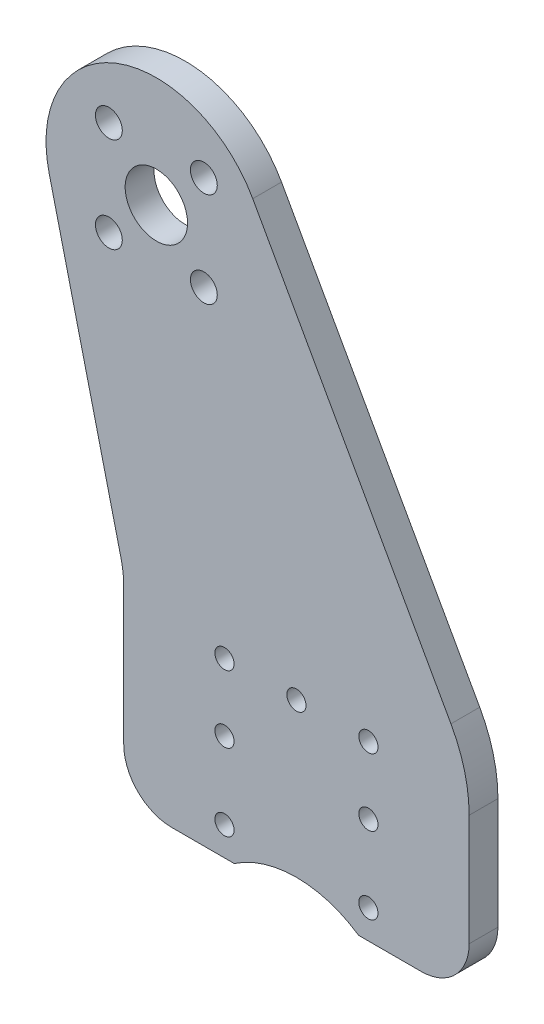
ISO-10303-21;
HEADER;
FILE_DESCRIPTION(('STEP AP214'),'2;1');
FILE_NAME('part.step','',(''),(''),'','','');
FILE_SCHEMA(('AUTOMOTIVE_DESIGN { 1 0 10303 214 1 1 1 1 }'));
ENDSEC;
DATA;
#1=APPLICATION_CONTEXT('core data for automotive mechanical design processes');
#2=APPLICATION_PROTOCOL_DEFINITION('international standard','automotive_design',2000,#1);
#3=PRODUCT_CONTEXT('',#1,'mechanical');
#4=PRODUCT('Part','Part','',(#3));
#5=PRODUCT_RELATED_PRODUCT_CATEGORY('part','',(#4));
#6=PRODUCT_DEFINITION_FORMATION('','',#4);
#7=PRODUCT_DEFINITION_CONTEXT('part definition',#1,'design');
#8=PRODUCT_DEFINITION('design','',#6,#7);
#9=PRODUCT_DEFINITION_SHAPE('','',#8);
#10=(LENGTH_UNIT() NAMED_UNIT(*) SI_UNIT(.MILLI.,.METRE.));
#11=(NAMED_UNIT(*) PLANE_ANGLE_UNIT() SI_UNIT($,.RADIAN.));
#12=(NAMED_UNIT(*) SI_UNIT($,.STERADIAN.) SOLID_ANGLE_UNIT());
#13=UNCERTAINTY_MEASURE_WITH_UNIT(LENGTH_MEASURE(1.E-05),#10,'distance_accuracy_value','');
#14=(GEOMETRIC_REPRESENTATION_CONTEXT(3) GLOBAL_UNCERTAINTY_ASSIGNED_CONTEXT((#13)) GLOBAL_UNIT_ASSIGNED_CONTEXT((#10,
#11,#12)) REPRESENTATION_CONTEXT('',''));
#15=CARTESIAN_POINT('',(0.,0.,0.));
#16=DIRECTION('',(0.,0.,1.));
#17=DIRECTION('',(1.,0.,0.));
#18=AXIS2_PLACEMENT_3D('',#15,#16,#17);
#19=CARTESIAN_POINT('',(14.6,-64.8774999518323,-3.));
#20=DIRECTION('',(0.,0.,1.));
#21=DIRECTION('',(1.,0.,0.));
#22=AXIS2_PLACEMENT_3D('',#19,#20,#21);
#23=CYLINDRICAL_SURFACE('',#22,11.5);
#24=CARTESIAN_POINT('',(14.6,-64.8774999518323,0.));
#25=DIRECTION('',(0.,0.,-1.));
#26=DIRECTION('',(1.,0.,0.));
#27=AXIS2_PLACEMENT_3D('',#24,#25,#26);
#28=CIRCLE('',#27,11.5);
#29=CARTESIAN_POINT('',(8.11925930159214,-55.3774999518323,0.));
#30=VERTEX_POINT('',#29);
#31=CARTESIAN_POINT('',(21.0807406984079,-55.3774999518323,0.));
#32=VERTEX_POINT('',#31);
#33=EDGE_CURVE('E155',#30,#32,#28,.T.);
#34=ORIENTED_EDGE('',*,*,#33,.F.);
#35=DIRECTION('',(0.,0.,1.));
#36=VECTOR('',#35,1.);
#37=CARTESIAN_POINT('',(8.11925930159214,-55.3774999518323,-3.));
#38=LINE('',#37,#36);
#39=CARTESIAN_POINT('',(8.11925930159214,-55.3774999518323,-3.));
#40=VERTEX_POINT('',#39);
#41=EDGE_CURVE('E11',#40,#30,#38,.T.);
#42=ORIENTED_EDGE('',*,*,#41,.F.);
#43=CARTESIAN_POINT('',(14.6,-64.8774999518323,-3.));
#44=DIRECTION('',(0.,0.,-1.));
#45=DIRECTION('',(1.,0.,0.));
#46=AXIS2_PLACEMENT_3D('',#43,#44,#45);
#47=CIRCLE('',#46,11.5);
#48=CARTESIAN_POINT('',(21.0807406984079,-55.3774999518323,-3.));
#49=VERTEX_POINT('',#48);
#50=EDGE_CURVE('E188',#40,#49,#47,.T.);
#51=ORIENTED_EDGE('',*,*,#50,.T.);
#52=DIRECTION('',(0.,0.,1.));
#53=VECTOR('',#52,1.);
#54=CARTESIAN_POINT('',(21.0807406984079,-55.3774999518323,-3.));
#55=LINE('',#54,#53);
#56=EDGE_CURVE('E37',#49,#32,#55,.T.);
#57=ORIENTED_EDGE('',*,*,#56,.T.);
#58=EDGE_LOOP('',(#34,#42,#51,#57));
#59=FACE_BOUND('',#58,.T.);
#60=ADVANCED_FACE('F34',(#59),#23,.F.);
#61=CARTESIAN_POINT('',(1.60000000000004,-55.3774999518323,-3.));
#62=DIRECTION('',(0.,-1.,0.));
#63=DIRECTION('',(0.,0.,-1.));
#64=AXIS2_PLACEMENT_3D('',#61,#62,#63);
#65=PLANE('',#64);
#66=DIRECTION('',(1.,0.,0.));
#67=VECTOR('',#66,1.);
#68=CARTESIAN_POINT('',(1.60000000000004,-55.3774999518323,0.));
#69=LINE('',#68,#67);
#70=CARTESIAN_POINT('',(1.60000000000004,-55.3774999518323,0.));
#71=VERTEX_POINT('',#70);
#72=EDGE_CURVE('E186',#71,#30,#69,.T.);
#73=ORIENTED_EDGE('',*,*,#72,.F.);
#74=DIRECTION('',(0.,0.,1.));
#75=VECTOR('',#74,1.);
#76=CARTESIAN_POINT('',(1.60000000000004,-55.3774999518323,-3.));
#77=LINE('',#76,#75);
#78=CARTESIAN_POINT('',(1.60000000000004,-55.3774999518323,-3.));
#79=VERTEX_POINT('',#78);
#80=EDGE_CURVE('E43',#79,#71,#77,.T.);
#81=ORIENTED_EDGE('',*,*,#80,.F.);
#82=DIRECTION('',(1.,0.,0.));
#83=VECTOR('',#82,1.);
#84=CARTESIAN_POINT('',(1.60000000000004,-55.3774999518323,-3.));
#85=LINE('',#84,#83);
#86=EDGE_CURVE('E145',#79,#40,#85,.T.);
#87=ORIENTED_EDGE('',*,*,#86,.T.);
#88=ORIENTED_EDGE('',*,*,#41,.T.);
#89=EDGE_LOOP('',(#73,#81,#87,#88));
#90=FACE_BOUND('',#89,.T.);
#91=ADVANCED_FACE('F208',(#90),#65,.T.);
#92=CARTESIAN_POINT('',(1.60000000000001,-50.3774999518323,-3.));
#93=DIRECTION('',(0.,0.,1.));
#94=DIRECTION('',(1.,0.,0.));
#95=AXIS2_PLACEMENT_3D('',#92,#93,#94);
#96=CYLINDRICAL_SURFACE('',#95,5.);
#97=CARTESIAN_POINT('',(1.60000000000001,-50.3774999518323,0.));
#98=DIRECTION('',(0.,0.,1.));
#99=DIRECTION('',(-1.,0.,0.));
#100=AXIS2_PLACEMENT_3D('',#97,#98,#99);
#101=CIRCLE('',#100,5.);
#102=CARTESIAN_POINT('',(-3.39999999999999,-50.3774999518323,0.));
#103=VERTEX_POINT('',#102);
#104=EDGE_CURVE('E132',#103,#71,#101,.T.);
#105=ORIENTED_EDGE('',*,*,#104,.F.);
#106=DIRECTION('',(0.,0.,1.));
#107=VECTOR('',#106,1.);
#108=CARTESIAN_POINT('',(-3.39999999999999,-50.3774999518323,-3.));
#109=LINE('',#108,#107);
#110=CARTESIAN_POINT('',(-3.39999999999999,-50.3774999518323,-3.));
#111=VERTEX_POINT('',#110);
#112=EDGE_CURVE('E127',#111,#103,#109,.T.);
#113=ORIENTED_EDGE('',*,*,#112,.F.);
#114=CARTESIAN_POINT('',(1.60000000000001,-50.3774999518323,-3.));
#115=DIRECTION('',(0.,0.,1.));
#116=DIRECTION('',(-1.,0.,0.));
#117=AXIS2_PLACEMENT_3D('',#114,#115,#116);
#118=CIRCLE('',#117,5.);
#119=EDGE_CURVE('E130',#111,#79,#118,.T.);
#120=ORIENTED_EDGE('',*,*,#119,.T.);
#121=ORIENTED_EDGE('',*,*,#80,.T.);
#122=EDGE_LOOP('',(#105,#113,#120,#121));
#123=FACE_BOUND('',#122,.T.);
#124=ADVANCED_FACE('F129',(#123),#96,.T.);
#125=CARTESIAN_POINT('',(-3.39999999999999,-36.0690336243878,-3.));
#126=DIRECTION('',(-1.,0.,0.));
#127=DIRECTION('',(0.,0.,1.));
#128=AXIS2_PLACEMENT_3D('',#125,#126,#127);
#129=PLANE('',#128);
#130=DIRECTION('',(0.,-1.,0.));
#131=VECTOR('',#130,1.);
#132=CARTESIAN_POINT('',(-3.39999999999999,-36.0690336243878,0.));
#133=LINE('',#132,#131);
#134=CARTESIAN_POINT('',(-3.39999999999999,-36.0690336243878,0.));
#135=VERTEX_POINT('',#134);
#136=EDGE_CURVE('E183',#135,#103,#133,.T.);
#137=ORIENTED_EDGE('',*,*,#136,.F.);
#138=DIRECTION('',(0.,0.,1.));
#139=VECTOR('',#138,1.);
#140=CARTESIAN_POINT('',(-3.39999999999999,-36.0690336243878,-3.));
#141=LINE('',#140,#139);
#142=CARTESIAN_POINT('',(-3.39999999999999,-36.0690336243878,-3.));
#143=VERTEX_POINT('',#142);
#144=EDGE_CURVE('E137',#143,#135,#141,.T.);
#145=ORIENTED_EDGE('',*,*,#144,.F.);
#146=DIRECTION('',(0.,-1.,0.));
#147=VECTOR('',#146,1.);
#148=CARTESIAN_POINT('',(-3.39999999999999,-36.0690336243878,-3.));
#149=LINE('',#148,#147);
#150=EDGE_CURVE('E143',#143,#111,#149,.T.);
#151=ORIENTED_EDGE('',*,*,#150,.T.);
#152=ORIENTED_EDGE('',*,*,#112,.T.);
#153=EDGE_LOOP('',(#137,#145,#151,#152));
#154=FACE_BOUND('',#153,.T.);
#155=ADVANCED_FACE('F147',(#154),#129,.T.);
#156=CARTESIAN_POINT('',(-13.4,-36.0690336243878,-3.));
#157=DIRECTION('',(0.,0.,1.));
#158=DIRECTION('',(1.,0.,0.));
#159=AXIS2_PLACEMENT_3D('',#156,#157,#158);
#160=CYLINDRICAL_SURFACE('',#159,10.);
#161=CARTESIAN_POINT('',(-13.4,-36.0690336243878,0.));
#162=DIRECTION('',(0.,0.,-1.));
#163=DIRECTION('',(1.,0.,0.));
#164=AXIS2_PLACEMENT_3D('',#161,#162,#163);
#165=CIRCLE('',#164,10.);
#166=CARTESIAN_POINT('',(-3.67997553887423,-33.7193263074828,0.));
#167=VERTEX_POINT('',#166);
#168=EDGE_CURVE('E180',#167,#135,#165,.T.);
#169=ORIENTED_EDGE('',*,*,#168,.F.);
#170=DIRECTION('',(0.,0.,1.));
#171=VECTOR('',#170,1.);
#172=CARTESIAN_POINT('',(-3.67997553887423,-33.7193263074828,-3.));
#173=LINE('',#172,#171);
#174=CARTESIAN_POINT('',(-3.67997553887423,-33.7193263074828,-3.));
#175=VERTEX_POINT('',#174);
#176=EDGE_CURVE('E192',#175,#167,#173,.T.);
#177=ORIENTED_EDGE('',*,*,#176,.F.);
#178=CARTESIAN_POINT('',(-13.4,-36.0690336243878,-3.));
#179=DIRECTION('',(0.,0.,-1.));
#180=DIRECTION('',(1.,0.,0.));
#181=AXIS2_PLACEMENT_3D('',#178,#179,#180);
#182=CIRCLE('',#181,10.);
#183=EDGE_CURVE('E148',#175,#143,#182,.T.);
#184=ORIENTED_EDGE('',*,*,#183,.T.);
#185=ORIENTED_EDGE('',*,*,#144,.T.);
#186=EDGE_LOOP('',(#169,#177,#184,#185));
#187=FACE_BOUND('',#186,.T.);
#188=ADVANCED_FACE('F221',(#187),#160,.F.);
#189=CARTESIAN_POINT('',(-3.67997553887423,-33.7193263074828,-3.));
#190=DIRECTION('',(-0.972002446112577,-0.234970731690495,0.));
#191=DIRECTION('',(0.234970731690495,-0.972002446112577,0.));
#192=AXIS2_PLACEMENT_3D('',#189,#190,#191);
#193=PLANE('',#192);
#194=DIRECTION('',(0.234970731690495,-0.972002446112577,0.));
#195=VECTOR('',#194,1.);
#196=CARTESIAN_POINT('',(-3.67997553887423,-33.7193263074828,0.));
#197=LINE('',#196,#195);
#198=CARTESIAN_POINT('',(-11.1780281302946,-2.70216341444069,0.));
#199=VERTEX_POINT('',#198);
#200=EDGE_CURVE('E177',#199,#167,#197,.T.);
#201=ORIENTED_EDGE('',*,*,#200,.F.);
#202=DIRECTION('',(0.,0.,1.));
#203=VECTOR('',#202,1.);
#204=CARTESIAN_POINT('',(-11.1780281302946,-2.70216341444069,-3.));
#205=LINE('',#204,#203);
#206=CARTESIAN_POINT('',(-11.1780281302946,-2.70216341444069,-3.));
#207=VERTEX_POINT('',#206);
#208=EDGE_CURVE('E194',#207,#199,#205,.T.);
#209=ORIENTED_EDGE('',*,*,#208,.F.);
#210=DIRECTION('',(0.234970731690495,-0.972002446112577,0.));
#211=VECTOR('',#210,1.);
#212=CARTESIAN_POINT('',(-3.67997553887423,-33.7193263074828,-3.));
#213=LINE('',#212,#211);
#214=EDGE_CURVE('E150',#207,#175,#213,.T.);
#215=ORIENTED_EDGE('',*,*,#214,.T.);
#216=ORIENTED_EDGE('',*,*,#176,.T.);
#217=EDGE_LOOP('',(#201,#209,#215,#216));
#218=FACE_BOUND('',#217,.T.);
#219=ADVANCED_FACE('F224',(#218),#193,.T.);
#220=CARTESIAN_POINT('',(0.,0.,-3.));
#221=DIRECTION('',(0.,0.,1.));
#222=DIRECTION('',(1.,0.,0.));
#223=AXIS2_PLACEMENT_3D('',#220,#221,#222);
#224=CYLINDRICAL_SURFACE('',#223,11.5);
#225=CARTESIAN_POINT('',(0.,0.,0.));
#226=DIRECTION('',(0.,0.,1.));
#227=DIRECTION('',(1.,0.,0.));
#228=AXIS2_PLACEMENT_3D('',#225,#226,#227);
#229=CIRCLE('',#228,11.5);
#230=CARTESIAN_POINT('',(10.0456256403877,5.59780363117403,0.));
#231=VERTEX_POINT('',#230);
#232=EDGE_CURVE('E174',#231,#199,#229,.T.);
#233=ORIENTED_EDGE('',*,*,#232,.F.);
#234=DIRECTION('',(0.,0.,1.));
#235=VECTOR('',#234,1.);
#236=CARTESIAN_POINT('',(10.0456256403877,5.59780363117403,-3.));
#237=LINE('',#236,#235);
#238=CARTESIAN_POINT('',(10.0456256403877,5.59780363117403,-3.));
#239=VERTEX_POINT('',#238);
#240=EDGE_CURVE('E196',#239,#231,#237,.T.);
#241=ORIENTED_EDGE('',*,*,#240,.F.);
#242=CARTESIAN_POINT('',(0.,0.,-3.));
#243=DIRECTION('',(0.,0.,1.));
#244=DIRECTION('',(1.,0.,0.));
#245=AXIS2_PLACEMENT_3D('',#242,#243,#244);
#246=CIRCLE('',#245,11.5);
#247=EDGE_CURVE('E398',#239,#207,#246,.T.);
#248=ORIENTED_EDGE('',*,*,#247,.T.);
#249=ORIENTED_EDGE('',*,*,#208,.T.);
#250=EDGE_LOOP('',(#233,#241,#248,#249));
#251=FACE_BOUND('',#250,.T.);
#252=ADVANCED_FACE('F228',(#251),#224,.T.);
#253=CARTESIAN_POINT('',(30.7029899657231,-31.4731910664189,-3.));
#254=DIRECTION('',(0.873532664381539,0.486765533145568,0.));
#255=DIRECTION('',(-0.486765533145568,0.873532664381539,0.));
#256=AXIS2_PLACEMENT_3D('',#253,#254,#255);
#257=PLANE('',#256);
#258=DIRECTION('',(-0.486765533145568,0.873532664381539,0.));
#259=VECTOR('',#258,1.);
#260=CARTESIAN_POINT('',(30.7029899657231,-31.4731910664189,0.));
#261=LINE('',#260,#259);
#262=CARTESIAN_POINT('',(30.7029899657231,-31.4731910664189,0.));
#263=VERTEX_POINT('',#262);
#264=EDGE_CURVE('E171',#263,#231,#261,.T.);
#265=ORIENTED_EDGE('',*,*,#264,.F.);
#266=DIRECTION('',(0.,0.,1.));
#267=VECTOR('',#266,1.);
#268=CARTESIAN_POINT('',(30.7029899657231,-31.4731910664189,-3.));
#269=LINE('',#268,#267);
#270=CARTESIAN_POINT('',(30.7029899657231,-31.4731910664189,-3.));
#271=VERTEX_POINT('',#270);
#272=EDGE_CURVE('E198',#271,#263,#269,.T.);
#273=ORIENTED_EDGE('',*,*,#272,.F.);
#274=DIRECTION('',(-0.486765533145568,0.873532664381539,0.));
#275=VECTOR('',#274,1.);
#276=CARTESIAN_POINT('',(30.7029899657231,-31.4731910664189,-3.));
#277=LINE('',#276,#275);
#278=EDGE_CURVE('E395',#271,#239,#277,.T.);
#279=ORIENTED_EDGE('',*,*,#278,.T.);
#280=ORIENTED_EDGE('',*,*,#240,.T.);
#281=EDGE_LOOP('',(#265,#273,#279,#280));
#282=FACE_BOUND('',#281,.T.);
#283=ADVANCED_FACE('F232',(#282),#257,.T.);
#284=CARTESIAN_POINT('',(17.6,-38.7746740636025,-3.));
#285=DIRECTION('',(0.,0.,1.));
#286=DIRECTION('',(1.,0.,0.));
#287=AXIS2_PLACEMENT_3D('',#284,#285,#286);
#288=CYLINDRICAL_SURFACE('',#287,15.);
#289=CARTESIAN_POINT('',(17.6,-38.7746740636025,0.));
#290=DIRECTION('',(0.,0.,1.));
#291=DIRECTION('',(1.,0.,0.));
#292=AXIS2_PLACEMENT_3D('',#289,#290,#291);
#293=CIRCLE('',#292,15.);
#294=CARTESIAN_POINT('',(32.6,-38.7746740636025,0.));
#295=VERTEX_POINT('',#294);
#296=EDGE_CURVE('E168',#295,#263,#293,.T.);
#297=ORIENTED_EDGE('',*,*,#296,.F.);
#298=DIRECTION('',(0.,0.,1.));
#299=VECTOR('',#298,1.);
#300=CARTESIAN_POINT('',(32.6,-38.7746740636025,-3.));
#301=LINE('',#300,#299);
#302=CARTESIAN_POINT('',(32.6,-38.7746740636025,-3.));
#303=VERTEX_POINT('',#302);
#304=EDGE_CURVE('E200',#303,#295,#301,.T.);
#305=ORIENTED_EDGE('',*,*,#304,.F.);
#306=CARTESIAN_POINT('',(17.6,-38.7746740636025,-3.));
#307=DIRECTION('',(0.,0.,1.));
#308=DIRECTION('',(1.,0.,0.));
#309=AXIS2_PLACEMENT_3D('',#306,#307,#308);
#310=CIRCLE('',#309,15.);
#311=EDGE_CURVE('E392',#303,#271,#310,.T.);
#312=ORIENTED_EDGE('',*,*,#311,.T.);
#313=ORIENTED_EDGE('',*,*,#272,.T.);
#314=EDGE_LOOP('',(#297,#305,#312,#313));
#315=FACE_BOUND('',#314,.T.);
#316=ADVANCED_FACE('F236',(#315),#288,.T.);
#317=CARTESIAN_POINT('',(32.6,-38.7746740636025,-3.));
#318=DIRECTION('',(1.,0.,0.));
#319=DIRECTION('',(0.,0.,-1.));
#320=AXIS2_PLACEMENT_3D('',#317,#318,#319);
#321=PLANE('',#320);
#322=DIRECTION('',(0.,1.,0.));
#323=VECTOR('',#322,1.);
#324=CARTESIAN_POINT('',(32.6,-38.7746740636025,0.));
#325=LINE('',#324,#323);
#326=CARTESIAN_POINT('',(32.6,-50.3774999518323,0.));
#327=VERTEX_POINT('',#326);
#328=EDGE_CURVE('E165',#327,#295,#325,.T.);
#329=ORIENTED_EDGE('',*,*,#328,.F.);
#330=DIRECTION('',(0.,0.,1.));
#331=VECTOR('',#330,1.);
#332=CARTESIAN_POINT('',(32.6,-50.3774999518323,-3.));
#333=LINE('',#332,#331);
#334=CARTESIAN_POINT('',(32.6,-50.3774999518323,-3.));
#335=VERTEX_POINT('',#334);
#336=EDGE_CURVE('E202',#335,#327,#333,.T.);
#337=ORIENTED_EDGE('',*,*,#336,.F.);
#338=DIRECTION('',(0.,1.,0.));
#339=VECTOR('',#338,1.);
#340=CARTESIAN_POINT('',(32.6,-38.7746740636025,-3.));
#341=LINE('',#340,#339);
#342=EDGE_CURVE('E389',#335,#303,#341,.T.);
#343=ORIENTED_EDGE('',*,*,#342,.T.);
#344=ORIENTED_EDGE('',*,*,#304,.T.);
#345=EDGE_LOOP('',(#329,#337,#343,#344));
#346=FACE_BOUND('',#345,.T.);
#347=ADVANCED_FACE('F240',(#346),#321,.T.);
#348=CARTESIAN_POINT('',(27.6,-50.3774999518323,-3.));
#349=DIRECTION('',(0.,0.,1.));
#350=DIRECTION('',(1.,0.,0.));
#351=AXIS2_PLACEMENT_3D('',#348,#349,#350);
#352=CYLINDRICAL_SURFACE('',#351,5.);
#353=CARTESIAN_POINT('',(27.6,-50.3774999518323,0.));
#354=DIRECTION('',(0.,0.,1.));
#355=DIRECTION('',(-1.,0.,0.));
#356=AXIS2_PLACEMENT_3D('',#353,#354,#355);
#357=CIRCLE('',#356,5.);
#358=CARTESIAN_POINT('',(27.6,-55.3774999518323,0.));
#359=VERTEX_POINT('',#358);
#360=EDGE_CURVE('E162',#359,#327,#357,.T.);
#361=ORIENTED_EDGE('',*,*,#360,.F.);
#362=DIRECTION('',(0.,0.,1.));
#363=VECTOR('',#362,1.);
#364=CARTESIAN_POINT('',(27.6,-55.3774999518323,-3.));
#365=LINE('',#364,#363);
#366=CARTESIAN_POINT('',(27.6,-55.3774999518323,-3.));
#367=VERTEX_POINT('',#366);
#368=EDGE_CURVE('E203',#367,#359,#365,.T.);
#369=ORIENTED_EDGE('',*,*,#368,.F.);
#370=CARTESIAN_POINT('',(27.6,-50.3774999518323,-3.));
#371=DIRECTION('',(0.,0.,1.));
#372=DIRECTION('',(-1.,0.,0.));
#373=AXIS2_PLACEMENT_3D('',#370,#371,#372);
#374=CIRCLE('',#373,5.);
#375=EDGE_CURVE('E386',#367,#335,#374,.T.);
#376=ORIENTED_EDGE('',*,*,#375,.T.);
#377=ORIENTED_EDGE('',*,*,#336,.T.);
#378=EDGE_LOOP('',(#361,#369,#376,#377));
#379=FACE_BOUND('',#378,.T.);
#380=ADVANCED_FACE('F244',(#379),#352,.T.);
#381=CARTESIAN_POINT('',(21.0807406984079,-55.3774999518323,-3.));
#382=DIRECTION('',(0.,-1.,0.));
#383=DIRECTION('',(0.,0.,-1.));
#384=AXIS2_PLACEMENT_3D('',#381,#382,#383);
#385=PLANE('',#384);
#386=DIRECTION('',(1.,0.,0.));
#387=VECTOR('',#386,1.);
#388=CARTESIAN_POINT('',(21.0807406984079,-55.3774999518323,0.));
#389=LINE('',#388,#387);
#390=EDGE_CURVE('E158',#32,#359,#389,.T.);
#391=ORIENTED_EDGE('',*,*,#390,.F.);
#392=ORIENTED_EDGE('',*,*,#56,.F.);
#393=DIRECTION('',(1.,0.,0.));
#394=VECTOR('',#393,1.);
#395=CARTESIAN_POINT('',(21.0807406984079,-55.3774999518323,-3.));
#396=LINE('',#395,#394);
#397=EDGE_CURVE('E384',#49,#367,#396,.T.);
#398=ORIENTED_EDGE('',*,*,#397,.T.);
#399=ORIENTED_EDGE('',*,*,#368,.T.);
#400=EDGE_LOOP('',(#391,#392,#398,#399));
#401=FACE_BOUND('',#400,.T.);
#402=ADVANCED_FACE('F205',(#401),#385,.T.);
#403=CARTESIAN_POINT('',(14.6,-64.8774999518323,-3.));
#404=DIRECTION('',(0.,0.,1.));
#405=DIRECTION('',(1.,0.,0.));
#406=AXIS2_PLACEMENT_3D('',#403,#404,#405);
#407=PLANE('',#406);
#408=CARTESIAN_POINT('',(7.10000000000001,-44.3774999518323,-3.));
#409=DIRECTION('',(0.,0.,1.));
#410=DIRECTION('',(1.,0.,0.));
#411=AXIS2_PLACEMENT_3D('',#408,#409,#410);
#412=CIRCLE('',#411,1.);
#413=CARTESIAN_POINT('',(8.10000000000001,-44.3774999518323,-3.));
#414=VERTEX_POINT('',#413);
#415=EDGE_CURVE('E311',#414,#414,#412,.T.);
#416=ORIENTED_EDGE('',*,*,#415,.T.);
#417=EDGE_LOOP('',(#416));
#418=FACE_BOUND('',#417,.T.);
#419=CARTESIAN_POINT('',(22.1,-44.3774999518323,-3.));
#420=DIRECTION('',(0.,0.,1.));
#421=DIRECTION('',(1.,0.,0.));
#422=AXIS2_PLACEMENT_3D('',#419,#420,#421);
#423=CIRCLE('',#422,1.);
#424=CARTESIAN_POINT('',(23.1,-44.3774999518323,-3.));
#425=VERTEX_POINT('',#424);
#426=EDGE_CURVE('E319',#425,#425,#423,.T.);
#427=ORIENTED_EDGE('',*,*,#426,.T.);
#428=EDGE_LOOP('',(#427));
#429=FACE_BOUND('',#428,.T.);
#430=CARTESIAN_POINT('',(14.6,-37.3774999518323,-3.));
#431=DIRECTION('',(0.,0.,1.));
#432=DIRECTION('',(1.,0.,0.));
#433=AXIS2_PLACEMENT_3D('',#430,#431,#432);
#434=CIRCLE('',#433,1.);
#435=CARTESIAN_POINT('',(15.6,-37.3774999518323,-3.));
#436=VERTEX_POINT('',#435);
#437=EDGE_CURVE('E325',#436,#436,#434,.T.);
#438=ORIENTED_EDGE('',*,*,#437,.T.);
#439=EDGE_LOOP('',(#438));
#440=FACE_BOUND('',#439,.T.);
#441=CARTESIAN_POINT('',(22.1,-52.3774999518323,-3.));
#442=DIRECTION('',(0.,0.,1.));
#443=DIRECTION('',(1.,0.,0.));
#444=AXIS2_PLACEMENT_3D('',#441,#442,#443);
#445=CIRCLE('',#444,1.);
#446=CARTESIAN_POINT('',(23.1,-52.3774999518323,-3.));
#447=VERTEX_POINT('',#446);
#448=EDGE_CURVE('E331',#447,#447,#445,.T.);
#449=ORIENTED_EDGE('',*,*,#448,.T.);
#450=EDGE_LOOP('',(#449));
#451=FACE_BOUND('',#450,.T.);
#452=CARTESIAN_POINT('',(7.10000000000001,-52.3774999518323,-3.));
#453=DIRECTION('',(0.,0.,1.));
#454=DIRECTION('',(1.,0.,0.));
#455=AXIS2_PLACEMENT_3D('',#452,#453,#454);
#456=CIRCLE('',#455,1.);
#457=CARTESIAN_POINT('',(8.10000000000001,-52.3774999518323,-3.));
#458=VERTEX_POINT('',#457);
#459=EDGE_CURVE('E337',#458,#458,#456,.T.);
#460=ORIENTED_EDGE('',*,*,#459,.T.);
#461=EDGE_LOOP('',(#460));
#462=FACE_BOUND('',#461,.T.);
#463=CARTESIAN_POINT('',(22.1,-37.3774999518323,-3.));
#464=DIRECTION('',(0.,0.,1.));
#465=DIRECTION('',(1.,0.,0.));
#466=AXIS2_PLACEMENT_3D('',#463,#464,#465);
#467=CIRCLE('',#466,1.);
#468=CARTESIAN_POINT('',(23.1,-37.3774999518323,-3.));
#469=VERTEX_POINT('',#468);
#470=EDGE_CURVE('E343',#469,#469,#467,.T.);
#471=ORIENTED_EDGE('',*,*,#470,.T.);
#472=EDGE_LOOP('',(#471));
#473=FACE_BOUND('',#472,.T.);
#474=CARTESIAN_POINT('',(7.10000000000001,-37.3774999518323,-3.));
#475=DIRECTION('',(0.,0.,1.));
#476=DIRECTION('',(1.,0.,0.));
#477=AXIS2_PLACEMENT_3D('',#474,#475,#476);
#478=CIRCLE('',#477,1.);
#479=CARTESIAN_POINT('',(8.10000000000001,-37.3774999518323,-3.));
#480=VERTEX_POINT('',#479);
#481=EDGE_CURVE('E349',#480,#480,#478,.T.);
#482=ORIENTED_EDGE('',*,*,#481,.T.);
#483=EDGE_LOOP('',(#482));
#484=FACE_BOUND('',#483,.T.);
#485=CARTESIAN_POINT('',(-4.94974746830583,-4.94974746830583,-3.));
#486=DIRECTION('',(0.,0.,1.));
#487=DIRECTION('',(1.,0.,0.));
#488=AXIS2_PLACEMENT_3D('',#485,#486,#487);
#489=CIRCLE('',#488,1.4);
#490=CARTESIAN_POINT('',(-3.54974746830583,-4.94974746830583,-3.));
#491=VERTEX_POINT('',#490);
#492=EDGE_CURVE('E355',#491,#491,#489,.T.);
#493=ORIENTED_EDGE('',*,*,#492,.T.);
#494=EDGE_LOOP('',(#493));
#495=FACE_BOUND('',#494,.T.);
#496=CARTESIAN_POINT('',(4.94974746830583,-4.94974746830583,-3.));
#497=DIRECTION('',(0.,0.,1.));
#498=DIRECTION('',(1.,0.,0.));
#499=AXIS2_PLACEMENT_3D('',#496,#497,#498);
#500=CIRCLE('',#499,1.4);
#501=CARTESIAN_POINT('',(6.34974746830583,-4.94974746830583,-3.));
#502=VERTEX_POINT('',#501);
#503=EDGE_CURVE('E361',#502,#502,#500,.T.);
#504=ORIENTED_EDGE('',*,*,#503,.T.);
#505=EDGE_LOOP('',(#504));
#506=FACE_BOUND('',#505,.T.);
#507=CARTESIAN_POINT('',(4.94974746830583,4.94974746830583,-3.));
#508=DIRECTION('',(0.,0.,1.));
#509=DIRECTION('',(1.,0.,0.));
#510=AXIS2_PLACEMENT_3D('',#507,#508,#509);
#511=CIRCLE('',#510,1.4);
#512=CARTESIAN_POINT('',(6.34974746830583,4.94974746830583,-3.));
#513=VERTEX_POINT('',#512);
#514=EDGE_CURVE('E367',#513,#513,#511,.T.);
#515=ORIENTED_EDGE('',*,*,#514,.T.);
#516=EDGE_LOOP('',(#515));
#517=FACE_BOUND('',#516,.T.);
#518=CARTESIAN_POINT('',(-4.94974746830583,4.94974746830583,-3.));
#519=DIRECTION('',(0.,0.,1.));
#520=DIRECTION('',(1.,0.,0.));
#521=AXIS2_PLACEMENT_3D('',#518,#519,#520);
#522=CIRCLE('',#521,1.4);
#523=CARTESIAN_POINT('',(-3.54974746830583,4.94974746830583,-3.));
#524=VERTEX_POINT('',#523);
#525=EDGE_CURVE('E373',#524,#524,#522,.T.);
#526=ORIENTED_EDGE('',*,*,#525,.T.);
#527=EDGE_LOOP('',(#526));
#528=FACE_BOUND('',#527,.T.);
#529=CARTESIAN_POINT('',(0.,0.,-3.));
#530=DIRECTION('',(0.,0.,1.));
#531=DIRECTION('',(1.,0.,0.));
#532=AXIS2_PLACEMENT_3D('',#529,#530,#531);
#533=CIRCLE('',#532,3.25);
#534=CARTESIAN_POINT('',(3.25,0.,-3.));
#535=VERTEX_POINT('',#534);
#536=EDGE_CURVE('E159',#535,#535,#533,.T.);
#537=ORIENTED_EDGE('',*,*,#536,.T.);
#538=EDGE_LOOP('',(#537));
#539=FACE_BOUND('',#538,.T.);
#540=ORIENTED_EDGE('',*,*,#50,.F.);
#541=ORIENTED_EDGE('',*,*,#86,.F.);
#542=ORIENTED_EDGE('',*,*,#119,.F.);
#543=ORIENTED_EDGE('',*,*,#150,.F.);
#544=ORIENTED_EDGE('',*,*,#183,.F.);
#545=ORIENTED_EDGE('',*,*,#214,.F.);
#546=ORIENTED_EDGE('',*,*,#247,.F.);
#547=ORIENTED_EDGE('',*,*,#278,.F.);
#548=ORIENTED_EDGE('',*,*,#311,.F.);
#549=ORIENTED_EDGE('',*,*,#342,.F.);
#550=ORIENTED_EDGE('',*,*,#375,.F.);
#551=ORIENTED_EDGE('',*,*,#397,.F.);
#552=EDGE_LOOP('',(#540,#541,#542,#543,#544,#545,#546,#547,#548,#549,#550,#551));
#553=FACE_BOUND('',#552,.T.);
#554=ADVANCED_FACE('F141',(#418,#429,#440,#451,#462,#473,#484,#495,#506,#517,#528,#539,#553),
#407,.F.);
#555=CARTESIAN_POINT('',(14.6,-64.8774999518323,0.));
#556=DIRECTION('',(0.,0.,1.));
#557=DIRECTION('',(1.,0.,0.));
#558=AXIS2_PLACEMENT_3D('',#555,#556,#557);
#559=PLANE('',#558);
#560=CARTESIAN_POINT('',(7.10000000000001,-44.3774999518323,0.));
#561=DIRECTION('',(0.,0.,1.));
#562=DIRECTION('',(1.,0.,0.));
#563=AXIS2_PLACEMENT_3D('',#560,#561,#562);
#564=CIRCLE('',#563,1.);
#565=CARTESIAN_POINT('',(8.10000000000001,-44.3774999518323,0.));
#566=VERTEX_POINT('',#565);
#567=EDGE_CURVE('E314',#566,#566,#564,.T.);
#568=ORIENTED_EDGE('',*,*,#567,.F.);
#569=EDGE_LOOP('',(#568));
#570=FACE_BOUND('',#569,.T.);
#571=CARTESIAN_POINT('',(22.1,-44.3774999518323,0.));
#572=DIRECTION('',(0.,0.,1.));
#573=DIRECTION('',(1.,0.,0.));
#574=AXIS2_PLACEMENT_3D('',#571,#572,#573);
#575=CIRCLE('',#574,1.);
#576=CARTESIAN_POINT('',(23.1,-44.3774999518323,0.));
#577=VERTEX_POINT('',#576);
#578=EDGE_CURVE('E316',#577,#577,#575,.T.);
#579=ORIENTED_EDGE('',*,*,#578,.F.);
#580=EDGE_LOOP('',(#579));
#581=FACE_BOUND('',#580,.T.);
#582=CARTESIAN_POINT('',(14.6,-37.3774999518323,0.));
#583=DIRECTION('',(0.,0.,1.));
#584=DIRECTION('',(1.,0.,0.));
#585=AXIS2_PLACEMENT_3D('',#582,#583,#584);
#586=CIRCLE('',#585,1.);
#587=CARTESIAN_POINT('',(15.6,-37.3774999518323,0.));
#588=VERTEX_POINT('',#587);
#589=EDGE_CURVE('E322',#588,#588,#586,.T.);
#590=ORIENTED_EDGE('',*,*,#589,.F.);
#591=EDGE_LOOP('',(#590));
#592=FACE_BOUND('',#591,.T.);
#593=CARTESIAN_POINT('',(22.1,-52.3774999518323,0.));
#594=DIRECTION('',(0.,0.,1.));
#595=DIRECTION('',(1.,0.,0.));
#596=AXIS2_PLACEMENT_3D('',#593,#594,#595);
#597=CIRCLE('',#596,1.);
#598=CARTESIAN_POINT('',(23.1,-52.3774999518323,0.));
#599=VERTEX_POINT('',#598);
#600=EDGE_CURVE('E328',#599,#599,#597,.T.);
#601=ORIENTED_EDGE('',*,*,#600,.F.);
#602=EDGE_LOOP('',(#601));
#603=FACE_BOUND('',#602,.T.);
#604=CARTESIAN_POINT('',(7.10000000000001,-52.3774999518323,0.));
#605=DIRECTION('',(0.,0.,1.));
#606=DIRECTION('',(1.,0.,0.));
#607=AXIS2_PLACEMENT_3D('',#604,#605,#606);
#608=CIRCLE('',#607,1.);
#609=CARTESIAN_POINT('',(8.10000000000001,-52.3774999518323,0.));
#610=VERTEX_POINT('',#609);
#611=EDGE_CURVE('E334',#610,#610,#608,.T.);
#612=ORIENTED_EDGE('',*,*,#611,.F.);
#613=EDGE_LOOP('',(#612));
#614=FACE_BOUND('',#613,.T.);
#615=CARTESIAN_POINT('',(22.1,-37.3774999518323,0.));
#616=DIRECTION('',(0.,0.,1.));
#617=DIRECTION('',(1.,0.,0.));
#618=AXIS2_PLACEMENT_3D('',#615,#616,#617);
#619=CIRCLE('',#618,1.);
#620=CARTESIAN_POINT('',(23.1,-37.3774999518323,0.));
#621=VERTEX_POINT('',#620);
#622=EDGE_CURVE('E340',#621,#621,#619,.T.);
#623=ORIENTED_EDGE('',*,*,#622,.F.);
#624=EDGE_LOOP('',(#623));
#625=FACE_BOUND('',#624,.T.);
#626=CARTESIAN_POINT('',(7.10000000000001,-37.3774999518323,0.));
#627=DIRECTION('',(0.,0.,1.));
#628=DIRECTION('',(1.,0.,0.));
#629=AXIS2_PLACEMENT_3D('',#626,#627,#628);
#630=CIRCLE('',#629,1.);
#631=CARTESIAN_POINT('',(8.10000000000001,-37.3774999518323,0.));
#632=VERTEX_POINT('',#631);
#633=EDGE_CURVE('E346',#632,#632,#630,.T.);
#634=ORIENTED_EDGE('',*,*,#633,.F.);
#635=EDGE_LOOP('',(#634));
#636=FACE_BOUND('',#635,.T.);
#637=CARTESIAN_POINT('',(-4.94974746830583,-4.94974746830583,0.));
#638=DIRECTION('',(0.,0.,1.));
#639=DIRECTION('',(1.,0.,0.));
#640=AXIS2_PLACEMENT_3D('',#637,#638,#639);
#641=CIRCLE('',#640,1.4);
#642=CARTESIAN_POINT('',(-3.54974746830583,-4.94974746830583,0.));
#643=VERTEX_POINT('',#642);
#644=EDGE_CURVE('E352',#643,#643,#641,.T.);
#645=ORIENTED_EDGE('',*,*,#644,.F.);
#646=EDGE_LOOP('',(#645));
#647=FACE_BOUND('',#646,.T.);
#648=CARTESIAN_POINT('',(4.94974746830583,-4.94974746830583,0.));
#649=DIRECTION('',(0.,0.,1.));
#650=DIRECTION('',(1.,0.,0.));
#651=AXIS2_PLACEMENT_3D('',#648,#649,#650);
#652=CIRCLE('',#651,1.4);
#653=CARTESIAN_POINT('',(6.34974746830583,-4.94974746830583,0.));
#654=VERTEX_POINT('',#653);
#655=EDGE_CURVE('E358',#654,#654,#652,.T.);
#656=ORIENTED_EDGE('',*,*,#655,.F.);
#657=EDGE_LOOP('',(#656));
#658=FACE_BOUND('',#657,.T.);
#659=CARTESIAN_POINT('',(4.94974746830583,4.94974746830583,0.));
#660=DIRECTION('',(0.,0.,1.));
#661=DIRECTION('',(1.,0.,0.));
#662=AXIS2_PLACEMENT_3D('',#659,#660,#661);
#663=CIRCLE('',#662,1.4);
#664=CARTESIAN_POINT('',(6.34974746830583,4.94974746830583,0.));
#665=VERTEX_POINT('',#664);
#666=EDGE_CURVE('E364',#665,#665,#663,.T.);
#667=ORIENTED_EDGE('',*,*,#666,.F.);
#668=EDGE_LOOP('',(#667));
#669=FACE_BOUND('',#668,.T.);
#670=CARTESIAN_POINT('',(-4.94974746830583,4.94974746830583,0.));
#671=DIRECTION('',(0.,0.,1.));
#672=DIRECTION('',(1.,0.,0.));
#673=AXIS2_PLACEMENT_3D('',#670,#671,#672);
#674=CIRCLE('',#673,1.4);
#675=CARTESIAN_POINT('',(-3.54974746830583,4.94974746830583,0.));
#676=VERTEX_POINT('',#675);
#677=EDGE_CURVE('E370',#676,#676,#674,.T.);
#678=ORIENTED_EDGE('',*,*,#677,.F.);
#679=EDGE_LOOP('',(#678));
#680=FACE_BOUND('',#679,.T.);
#681=CARTESIAN_POINT('',(0.,0.,0.));
#682=DIRECTION('',(0.,0.,1.));
#683=DIRECTION('',(1.,0.,0.));
#684=AXIS2_PLACEMENT_3D('',#681,#682,#683);
#685=CIRCLE('',#684,3.25);
#686=CARTESIAN_POINT('',(3.25,0.,0.));
#687=VERTEX_POINT('',#686);
#688=EDGE_CURVE('E376',#687,#687,#685,.T.);
#689=ORIENTED_EDGE('',*,*,#688,.F.);
#690=EDGE_LOOP('',(#689));
#691=FACE_BOUND('',#690,.T.);
#692=ORIENTED_EDGE('',*,*,#33,.T.);
#693=ORIENTED_EDGE('',*,*,#390,.T.);
#694=ORIENTED_EDGE('',*,*,#360,.T.);
#695=ORIENTED_EDGE('',*,*,#328,.T.);
#696=ORIENTED_EDGE('',*,*,#296,.T.);
#697=ORIENTED_EDGE('',*,*,#264,.T.);
#698=ORIENTED_EDGE('',*,*,#232,.T.);
#699=ORIENTED_EDGE('',*,*,#200,.T.);
#700=ORIENTED_EDGE('',*,*,#168,.T.);
#701=ORIENTED_EDGE('',*,*,#136,.T.);
#702=ORIENTED_EDGE('',*,*,#104,.T.);
#703=ORIENTED_EDGE('',*,*,#72,.T.);
#704=EDGE_LOOP('',(#692,#693,#694,#695,#696,#697,#698,#699,#700,#701,#702,#703));
#705=FACE_BOUND('',#704,.T.);
#706=ADVANCED_FACE('F207',(#570,#581,#592,#603,#614,#625,#636,#647,#658,#669,#680,#691,#705),
#559,.T.);
#707=CARTESIAN_POINT('',(0.,0.,-3.));
#708=DIRECTION('',(0.,0.,1.));
#709=DIRECTION('',(1.,0.,0.));
#710=AXIS2_PLACEMENT_3D('',#707,#708,#709);
#711=CYLINDRICAL_SURFACE('',#710,3.25);
#712=ORIENTED_EDGE('',*,*,#536,.F.);
#713=EDGE_LOOP('',(#712));
#714=FACE_BOUND('',#713,.T.);
#715=ORIENTED_EDGE('',*,*,#688,.T.);
#716=EDGE_LOOP('',(#715));
#717=FACE_BOUND('',#716,.T.);
#718=ADVANCED_FACE('F256',(#714,#717),#711,.F.);
#719=CARTESIAN_POINT('',(-4.94974746830583,4.94974746830583,-3.));
#720=DIRECTION('',(0.,0.,1.));
#721=DIRECTION('',(1.,0.,0.));
#722=AXIS2_PLACEMENT_3D('',#719,#720,#721);
#723=CYLINDRICAL_SURFACE('',#722,1.4);
#724=ORIENTED_EDGE('',*,*,#525,.F.);
#725=EDGE_LOOP('',(#724));
#726=FACE_BOUND('',#725,.T.);
#727=ORIENTED_EDGE('',*,*,#677,.T.);
#728=EDGE_LOOP('',(#727));
#729=FACE_BOUND('',#728,.T.);
#730=ADVANCED_FACE('F263',(#726,#729),#723,.F.);
#731=CARTESIAN_POINT('',(4.94974746830583,4.94974746830583,-3.));
#732=DIRECTION('',(0.,0.,1.));
#733=DIRECTION('',(1.,0.,0.));
#734=AXIS2_PLACEMENT_3D('',#731,#732,#733);
#735=CYLINDRICAL_SURFACE('',#734,1.4);
#736=ORIENTED_EDGE('',*,*,#514,.F.);
#737=EDGE_LOOP('',(#736));
#738=FACE_BOUND('',#737,.T.);
#739=ORIENTED_EDGE('',*,*,#666,.T.);
#740=EDGE_LOOP('',(#739));
#741=FACE_BOUND('',#740,.T.);
#742=ADVANCED_FACE('F267',(#738,#741),#735,.F.);
#743=CARTESIAN_POINT('',(4.94974746830583,-4.94974746830583,-3.));
#744=DIRECTION('',(0.,0.,1.));
#745=DIRECTION('',(1.,0.,0.));
#746=AXIS2_PLACEMENT_3D('',#743,#744,#745);
#747=CYLINDRICAL_SURFACE('',#746,1.4);
#748=ORIENTED_EDGE('',*,*,#503,.F.);
#749=EDGE_LOOP('',(#748));
#750=FACE_BOUND('',#749,.T.);
#751=ORIENTED_EDGE('',*,*,#655,.T.);
#752=EDGE_LOOP('',(#751));
#753=FACE_BOUND('',#752,.T.);
#754=ADVANCED_FACE('F271',(#750,#753),#747,.F.);
#755=CARTESIAN_POINT('',(-4.94974746830583,-4.94974746830583,-3.));
#756=DIRECTION('',(0.,0.,1.));
#757=DIRECTION('',(1.,0.,0.));
#758=AXIS2_PLACEMENT_3D('',#755,#756,#757);
#759=CYLINDRICAL_SURFACE('',#758,1.4);
#760=ORIENTED_EDGE('',*,*,#492,.F.);
#761=EDGE_LOOP('',(#760));
#762=FACE_BOUND('',#761,.T.);
#763=ORIENTED_EDGE('',*,*,#644,.T.);
#764=EDGE_LOOP('',(#763));
#765=FACE_BOUND('',#764,.T.);
#766=ADVANCED_FACE('F275',(#762,#765),#759,.F.);
#767=CARTESIAN_POINT('',(7.10000000000001,-37.3774999518323,-3.));
#768=DIRECTION('',(0.,0.,1.));
#769=DIRECTION('',(1.,0.,0.));
#770=AXIS2_PLACEMENT_3D('',#767,#768,#769);
#771=CYLINDRICAL_SURFACE('',#770,1.);
#772=ORIENTED_EDGE('',*,*,#481,.F.);
#773=EDGE_LOOP('',(#772));
#774=FACE_BOUND('',#773,.T.);
#775=ORIENTED_EDGE('',*,*,#633,.T.);
#776=EDGE_LOOP('',(#775));
#777=FACE_BOUND('',#776,.T.);
#778=ADVANCED_FACE('F279',(#774,#777),#771,.F.);
#779=CARTESIAN_POINT('',(22.1,-37.3774999518323,-3.));
#780=DIRECTION('',(0.,0.,1.));
#781=DIRECTION('',(1.,0.,0.));
#782=AXIS2_PLACEMENT_3D('',#779,#780,#781);
#783=CYLINDRICAL_SURFACE('',#782,1.);
#784=ORIENTED_EDGE('',*,*,#470,.F.);
#785=EDGE_LOOP('',(#784));
#786=FACE_BOUND('',#785,.T.);
#787=ORIENTED_EDGE('',*,*,#622,.T.);
#788=EDGE_LOOP('',(#787));
#789=FACE_BOUND('',#788,.T.);
#790=ADVANCED_FACE('F283',(#786,#789),#783,.F.);
#791=CARTESIAN_POINT('',(7.10000000000001,-52.3774999518323,-3.));
#792=DIRECTION('',(0.,0.,1.));
#793=DIRECTION('',(1.,0.,0.));
#794=AXIS2_PLACEMENT_3D('',#791,#792,#793);
#795=CYLINDRICAL_SURFACE('',#794,1.);
#796=ORIENTED_EDGE('',*,*,#459,.F.);
#797=EDGE_LOOP('',(#796));
#798=FACE_BOUND('',#797,.T.);
#799=ORIENTED_EDGE('',*,*,#611,.T.);
#800=EDGE_LOOP('',(#799));
#801=FACE_BOUND('',#800,.T.);
#802=ADVANCED_FACE('F287',(#798,#801),#795,.F.);
#803=CARTESIAN_POINT('',(22.1,-52.3774999518323,-3.));
#804=DIRECTION('',(0.,0.,1.));
#805=DIRECTION('',(1.,0.,0.));
#806=AXIS2_PLACEMENT_3D('',#803,#804,#805);
#807=CYLINDRICAL_SURFACE('',#806,1.);
#808=ORIENTED_EDGE('',*,*,#448,.F.);
#809=EDGE_LOOP('',(#808));
#810=FACE_BOUND('',#809,.T.);
#811=ORIENTED_EDGE('',*,*,#600,.T.);
#812=EDGE_LOOP('',(#811));
#813=FACE_BOUND('',#812,.T.);
#814=ADVANCED_FACE('F291',(#810,#813),#807,.F.);
#815=CARTESIAN_POINT('',(14.6,-37.3774999518323,-3.));
#816=DIRECTION('',(0.,0.,1.));
#817=DIRECTION('',(1.,0.,0.));
#818=AXIS2_PLACEMENT_3D('',#815,#816,#817);
#819=CYLINDRICAL_SURFACE('',#818,1.);
#820=ORIENTED_EDGE('',*,*,#437,.F.);
#821=EDGE_LOOP('',(#820));
#822=FACE_BOUND('',#821,.T.);
#823=ORIENTED_EDGE('',*,*,#589,.T.);
#824=EDGE_LOOP('',(#823));
#825=FACE_BOUND('',#824,.T.);
#826=ADVANCED_FACE('F295',(#822,#825),#819,.F.);
#827=CARTESIAN_POINT('',(22.1,-44.3774999518323,-3.));
#828=DIRECTION('',(0.,0.,1.));
#829=DIRECTION('',(1.,0.,0.));
#830=AXIS2_PLACEMENT_3D('',#827,#828,#829);
#831=CYLINDRICAL_SURFACE('',#830,1.);
#832=ORIENTED_EDGE('',*,*,#426,.F.);
#833=EDGE_LOOP('',(#832));
#834=FACE_BOUND('',#833,.T.);
#835=ORIENTED_EDGE('',*,*,#578,.T.);
#836=EDGE_LOOP('',(#835));
#837=FACE_BOUND('',#836,.T.);
#838=ADVANCED_FACE('F299',(#834,#837),#831,.F.);
#839=CARTESIAN_POINT('',(7.10000000000001,-44.3774999518323,-3.));
#840=DIRECTION('',(0.,0.,1.));
#841=DIRECTION('',(1.,0.,0.));
#842=AXIS2_PLACEMENT_3D('',#839,#840,#841);
#843=CYLINDRICAL_SURFACE('',#842,1.);
#844=ORIENTED_EDGE('',*,*,#415,.F.);
#845=EDGE_LOOP('',(#844));
#846=FACE_BOUND('',#845,.T.);
#847=ORIENTED_EDGE('',*,*,#567,.T.);
#848=EDGE_LOOP('',(#847));
#849=FACE_BOUND('',#848,.T.);
#850=ADVANCED_FACE('F303',(#846,#849),#843,.F.);
#851=CLOSED_SHELL('',(#60,#91,#124,#155,#188,#219,#252,#283,#316,#347,#380,#402,#554,#706,#718,
#730,#742,#754,#766,#778,#790,#802,#814,#826,#838,#850));
#852=MANIFOLD_SOLID_BREP('B2',#851);
#853=ADVANCED_BREP_SHAPE_REPRESENTATION('',(#18,#852),#14);
#854=SHAPE_DEFINITION_REPRESENTATION(#9,#853);
ENDSEC;
END-ISO-10303-21;
